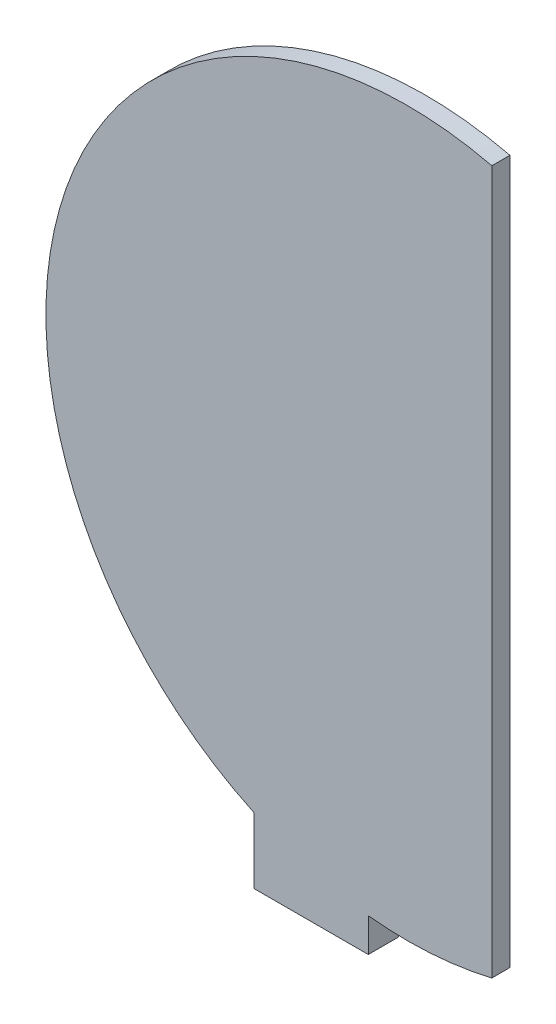
ISO-10303-21;
HEADER;
FILE_DESCRIPTION(('STEP AP214'),'2;1');
FILE_NAME('part.step','',(''),(''),'','','');
FILE_SCHEMA(('AUTOMOTIVE_DESIGN { 1 0 10303 214 1 1 1 1 }'));
ENDSEC;
DATA;
#1=APPLICATION_CONTEXT('core data for automotive mechanical design processes');
#2=APPLICATION_PROTOCOL_DEFINITION('international standard','automotive_design',2000,#1);
#3=PRODUCT_CONTEXT('',#1,'mechanical');
#4=PRODUCT('Part','Part','',(#3));
#5=PRODUCT_RELATED_PRODUCT_CATEGORY('part','',(#4));
#6=PRODUCT_DEFINITION_FORMATION('','',#4);
#7=PRODUCT_DEFINITION_CONTEXT('part definition',#1,'design');
#8=PRODUCT_DEFINITION('design','',#6,#7);
#9=PRODUCT_DEFINITION_SHAPE('','',#8);
#10=(LENGTH_UNIT() NAMED_UNIT(*) SI_UNIT(.MILLI.,.METRE.));
#11=(NAMED_UNIT(*) PLANE_ANGLE_UNIT() SI_UNIT($,.RADIAN.));
#12=(NAMED_UNIT(*) SI_UNIT($,.STERADIAN.) SOLID_ANGLE_UNIT());
#13=UNCERTAINTY_MEASURE_WITH_UNIT(LENGTH_MEASURE(1.E-05),#10,'distance_accuracy_value','');
#14=(GEOMETRIC_REPRESENTATION_CONTEXT(3) GLOBAL_UNCERTAINTY_ASSIGNED_CONTEXT((#13)) GLOBAL_UNIT_ASSIGNED_CONTEXT((#10,
#11,#12)) REPRESENTATION_CONTEXT('',''));
#15=CARTESIAN_POINT('',(0.,0.,0.));
#16=DIRECTION('',(0.,0.,1.));
#17=DIRECTION('',(1.,0.,0.));
#18=AXIS2_PLACEMENT_3D('',#15,#16,#17);
#19=CARTESIAN_POINT('',(-2.56182587296405,15.1062106918239,3.));
#20=DIRECTION('',(0.,0.,-1.));
#21=DIRECTION('',(-1.,0.,0.));
#22=AXIS2_PLACEMENT_3D('',#19,#20,#21);
#23=CYLINDRICAL_SURFACE('',#22,60.);
#24=CARTESIAN_POINT('',(-2.56182587296405,15.1062106918239,0.));
#25=DIRECTION('',(0.,0.,1.));
#26=DIRECTION('',(1.,0.,0.));
#27=AXIS2_PLACEMENT_3D('',#24,#25,#26);
#28=CIRCLE('',#27,60.);
#29=CARTESIAN_POINT('',(11.4193016972997,73.4545446171727,0.));
#30=VERTEX_POINT('',#29);
#31=CARTESIAN_POINT('',(-28.0806983027003,-39.1965254263023,0.));
#32=VERTEX_POINT('',#31);
#33=EDGE_CURVE('E81',#30,#32,#28,.T.);
#34=ORIENTED_EDGE('',*,*,#33,.T.);
#35=DIRECTION('',(0.,0.,-1.));
#36=VECTOR('',#35,1.);
#37=CARTESIAN_POINT('',(-28.0806983027003,-39.1965254263023,3.));
#38=LINE('',#37,#36);
#39=CARTESIAN_POINT('',(-28.0806983027003,-39.1965254263023,3.));
#40=VERTEX_POINT('',#39);
#41=EDGE_CURVE('E93',#32,#40,#38,.F.);
#42=ORIENTED_EDGE('',*,*,#41,.T.);
#43=CARTESIAN_POINT('',(-2.56182587296405,15.1062106918239,3.));
#44=DIRECTION('',(0.,0.,1.));
#45=DIRECTION('',(1.,0.,0.));
#46=AXIS2_PLACEMENT_3D('',#43,#44,#45);
#47=CIRCLE('',#46,60.);
#48=CARTESIAN_POINT('',(11.4193016972997,73.4545446171727,3.));
#49=VERTEX_POINT('',#48);
#50=EDGE_CURVE('E86',#49,#40,#47,.T.);
#51=ORIENTED_EDGE('',*,*,#50,.F.);
#52=DIRECTION('',(0.,0.,-1.));
#53=VECTOR('',#52,1.);
#54=CARTESIAN_POINT('',(11.4193016972997,73.4545446171727,3.));
#55=LINE('',#54,#53);
#56=EDGE_CURVE('E73',#49,#30,#55,.T.);
#57=ORIENTED_EDGE('',*,*,#56,.T.);
#58=EDGE_LOOP('',(#34,#42,#51,#57));
#59=FACE_BOUND('',#58,.T.);
#60=ADVANCED_FACE('F33',(#59),#23,.T.);
#61=CARTESIAN_POINT('',(-9.08069830270029,-44.538607207511,3.));
#62=VERTEX_POINT('',#61);
#63=CARTESIAN_POINT('',(11.4193016972997,-43.2421232335249,3.));
#64=VERTEX_POINT('',#63);
#65=EDGE_CURVE('E80',#62,#64,#47,.T.);
#66=ORIENTED_EDGE('',*,*,#65,.F.);
#67=DIRECTION('',(0.,0.,-1.));
#68=VECTOR('',#67,1.);
#69=CARTESIAN_POINT('',(-9.08069830270029,-44.538607207511,3.));
#70=LINE('',#69,#68);
#71=CARTESIAN_POINT('',(-9.08069830270029,-44.538607207511,0.));
#72=VERTEX_POINT('',#71);
#73=EDGE_CURVE('E120',#62,#72,#70,.T.);
#74=ORIENTED_EDGE('',*,*,#73,.T.);
#75=CARTESIAN_POINT('',(11.4193016972997,-43.2421232335249,0.));
#76=VERTEX_POINT('',#75);
#77=EDGE_CURVE('E91',#72,#76,#28,.T.);
#78=ORIENTED_EDGE('',*,*,#77,.T.);
#79=DIRECTION('',(0.,0.,-1.));
#80=VECTOR('',#79,1.);
#81=CARTESIAN_POINT('',(11.4193016972997,-43.2421232335249,3.));
#82=LINE('',#81,#80);
#83=EDGE_CURVE('E76',#64,#76,#82,.T.);
#84=ORIENTED_EDGE('',*,*,#83,.F.);
#85=EDGE_LOOP('',(#66,#74,#78,#84));
#86=FACE_BOUND('',#85,.T.);
#87=ADVANCED_FACE('F35',(#86),#23,.T.);
#88=CARTESIAN_POINT('',(11.4193016972997,73.4545446171727,3.));
#89=DIRECTION('',(-1.,0.,0.));
#90=DIRECTION('',(0.,0.,1.));
#91=AXIS2_PLACEMENT_3D('',#88,#89,#90);
#92=PLANE('',#91);
#93=DIRECTION('',(0.,1.,0.));
#94=VECTOR('',#93,1.);
#95=CARTESIAN_POINT('',(11.4193016972997,73.4545446171727,0.));
#96=LINE('',#95,#94);
#97=EDGE_CURVE('E70',#76,#30,#96,.T.);
#98=ORIENTED_EDGE('',*,*,#97,.T.);
#99=ORIENTED_EDGE('',*,*,#56,.F.);
#100=DIRECTION('',(0.,1.,0.));
#101=VECTOR('',#100,1.);
#102=CARTESIAN_POINT('',(11.4193016972997,73.4545446171727,3.));
#103=LINE('',#102,#101);
#104=EDGE_CURVE('E57',#64,#49,#103,.T.);
#105=ORIENTED_EDGE('',*,*,#104,.F.);
#106=ORIENTED_EDGE('',*,*,#83,.T.);
#107=EDGE_LOOP('',(#98,#99,#105,#106));
#108=FACE_BOUND('',#107,.T.);
#109=ADVANCED_FACE('F72',(#108),#92,.F.);
#110=CARTESIAN_POINT('',(-2.56182587296405,15.1062106918239,3.));
#111=DIRECTION('',(0.,0.,1.));
#112=DIRECTION('',(1.,0.,0.));
#113=AXIS2_PLACEMENT_3D('',#110,#111,#112);
#114=PLANE('',#113);
#115=ORIENTED_EDGE('',*,*,#50,.T.);
#116=DIRECTION('',(0.,-1.,0.));
#117=VECTOR('',#116,1.);
#118=CARTESIAN_POINT('',(-28.0806983027003,-50.1210917906914,3.));
#119=LINE('',#118,#117);
#120=CARTESIAN_POINT('',(-28.0806983027003,-50.1210917906914,3.));
#121=VERTEX_POINT('',#120);
#122=EDGE_CURVE('E149',#40,#121,#119,.T.);
#123=ORIENTED_EDGE('',*,*,#122,.T.);
#124=DIRECTION('',(1.,0.,0.));
#125=VECTOR('',#124,1.);
#126=CARTESIAN_POINT('',(-28.0806983027003,-50.1210917906914,3.));
#127=LINE('',#126,#125);
#128=CARTESIAN_POINT('',(-9.08069830270029,-50.1210917906914,3.));
#129=VERTEX_POINT('',#128);
#130=EDGE_CURVE('E157',#121,#129,#127,.T.);
#131=ORIENTED_EDGE('',*,*,#130,.T.);
#132=DIRECTION('',(0.,1.,0.));
#133=VECTOR('',#132,1.);
#134=CARTESIAN_POINT('',(-9.08069830270029,-50.1210917906914,3.));
#135=LINE('',#134,#133);
#136=EDGE_CURVE('E138',#129,#62,#135,.T.);
#137=ORIENTED_EDGE('',*,*,#136,.T.);
#138=ORIENTED_EDGE('',*,*,#65,.T.);
#139=ORIENTED_EDGE('',*,*,#104,.T.);
#140=EDGE_LOOP('',(#115,#123,#131,#137,#138,#139));
#141=FACE_BOUND('',#140,.T.);
#142=ADVANCED_FACE('F134',(#141),#114,.T.);
#143=CARTESIAN_POINT('',(-2.56182587296405,15.1062106918239,0.));
#144=DIRECTION('',(0.,0.,1.));
#145=DIRECTION('',(1.,0.,0.));
#146=AXIS2_PLACEMENT_3D('',#143,#144,#145);
#147=PLANE('',#146);
#148=DIRECTION('',(-1.,0.,0.));
#149=VECTOR('',#148,1.);
#150=CARTESIAN_POINT('',(-2.56182587296404,-25.7769929716059,0.));
#151=LINE('',#150,#149);
#152=CARTESIAN_POINT('',(-9.08069830270029,-25.7769929716059,0.));
#153=VERTEX_POINT('',#152);
#154=CARTESIAN_POINT('',(-28.0806983027003,-25.7769929716059,0.));
#155=VERTEX_POINT('',#154);
#156=EDGE_CURVE('E41',#153,#155,#151,.T.);
#157=ORIENTED_EDGE('',*,*,#156,.T.);
#158=DIRECTION('',(0.,-1.,0.));
#159=VECTOR('',#158,1.);
#160=CARTESIAN_POINT('',(-28.0806983027003,15.1062106918239,0.));
#161=LINE('',#160,#159);
#162=EDGE_CURVE('E11',#155,#32,#161,.T.);
#163=ORIENTED_EDGE('',*,*,#162,.T.);
#164=ORIENTED_EDGE('',*,*,#33,.F.);
#165=ORIENTED_EDGE('',*,*,#97,.F.);
#166=ORIENTED_EDGE('',*,*,#77,.F.);
#167=DIRECTION('',(0.,1.,0.));
#168=VECTOR('',#167,1.);
#169=CARTESIAN_POINT('',(-9.0806983027003,15.1062106918239,0.));
#170=LINE('',#169,#168);
#171=EDGE_CURVE('E98',#72,#153,#170,.T.);
#172=ORIENTED_EDGE('',*,*,#171,.T.);
#173=EDGE_LOOP('',(#157,#163,#164,#165,#166,#172));
#174=FACE_BOUND('',#173,.T.);
#175=ADVANCED_FACE('F89',(#174),#147,.F.);
#176=CARTESIAN_POINT('',(-28.0806983027003,-50.1210917906914,-2.));
#177=DIRECTION('',(-1.,0.,0.));
#178=DIRECTION('',(0.,-1.,0.));
#179=AXIS2_PLACEMENT_3D('',#176,#177,#178);
#180=PLANE('',#179);
#181=ORIENTED_EDGE('',*,*,#41,.F.);
#182=ORIENTED_EDGE('',*,*,#162,.F.);
#183=DIRECTION('',(0.,0.,1.));
#184=VECTOR('',#183,1.);
#185=CARTESIAN_POINT('',(-28.0806983027003,-25.7769929716059,-2.));
#186=LINE('',#185,#184);
#187=CARTESIAN_POINT('',(-28.0806983027003,-25.7769929716059,-2.));
#188=VERTEX_POINT('',#187);
#189=EDGE_CURVE('E111',#188,#155,#186,.T.);
#190=ORIENTED_EDGE('',*,*,#189,.F.);
#191=DIRECTION('',(0.,-1.,0.));
#192=VECTOR('',#191,1.);
#193=CARTESIAN_POINT('',(-28.0806983027003,-50.1210917906914,-2.));
#194=LINE('',#193,#192);
#195=CARTESIAN_POINT('',(-28.0806983027003,-50.1210917906914,-2.));
#196=VERTEX_POINT('',#195);
#197=EDGE_CURVE('E128',#188,#196,#194,.T.);
#198=ORIENTED_EDGE('',*,*,#197,.T.);
#199=DIRECTION('',(0.,0.,1.));
#200=VECTOR('',#199,1.);
#201=CARTESIAN_POINT('',(-28.0806983027003,-50.1210917906914,-2.));
#202=LINE('',#201,#200);
#203=EDGE_CURVE('E117',#196,#121,#202,.T.);
#204=ORIENTED_EDGE('',*,*,#203,.T.);
#205=ORIENTED_EDGE('',*,*,#122,.F.);
#206=EDGE_LOOP('',(#181,#182,#190,#198,#204,#205));
#207=FACE_BOUND('',#206,.T.);
#208=ADVANCED_FACE('F148',(#207),#180,.T.);
#209=CARTESIAN_POINT('',(-28.0806983027003,-25.7769929716059,-2.));
#210=DIRECTION('',(0.,1.,0.));
#211=DIRECTION('',(-1.,0.,0.));
#212=AXIS2_PLACEMENT_3D('',#209,#210,#211);
#213=PLANE('',#212);
#214=ORIENTED_EDGE('',*,*,#156,.F.);
#215=DIRECTION('',(0.,0.,1.));
#216=VECTOR('',#215,1.);
#217=CARTESIAN_POINT('',(-9.08069830270029,-25.7769929716059,-2.));
#218=LINE('',#217,#216);
#219=CARTESIAN_POINT('',(-9.08069830270029,-25.7769929716059,-2.));
#220=VERTEX_POINT('',#219);
#221=EDGE_CURVE('E48',#220,#153,#218,.T.);
#222=ORIENTED_EDGE('',*,*,#221,.F.);
#223=DIRECTION('',(-1.,0.,0.));
#224=VECTOR('',#223,1.);
#225=CARTESIAN_POINT('',(-28.0806983027003,-25.7769929716059,-2.));
#226=LINE('',#225,#224);
#227=EDGE_CURVE('E113',#220,#188,#226,.T.);
#228=ORIENTED_EDGE('',*,*,#227,.T.);
#229=ORIENTED_EDGE('',*,*,#189,.T.);
#230=EDGE_LOOP('',(#214,#222,#228,#229));
#231=FACE_BOUND('',#230,.T.);
#232=ADVANCED_FACE('F106',(#231),#213,.T.);
#233=CARTESIAN_POINT('',(-9.08069830270029,-50.1210917906914,-2.));
#234=DIRECTION('',(1.,0.,0.));
#235=DIRECTION('',(0.,1.,0.));
#236=AXIS2_PLACEMENT_3D('',#233,#234,#235);
#237=PLANE('',#236);
#238=ORIENTED_EDGE('',*,*,#73,.F.);
#239=ORIENTED_EDGE('',*,*,#136,.F.);
#240=DIRECTION('',(0.,0.,1.));
#241=VECTOR('',#240,1.);
#242=CARTESIAN_POINT('',(-9.08069830270029,-50.1210917906914,-2.));
#243=LINE('',#242,#241);
#244=CARTESIAN_POINT('',(-9.08069830270029,-50.1210917906914,-2.));
#245=VERTEX_POINT('',#244);
#246=EDGE_CURVE('E122',#245,#129,#243,.T.);
#247=ORIENTED_EDGE('',*,*,#246,.F.);
#248=DIRECTION('',(0.,1.,0.));
#249=VECTOR('',#248,1.);
#250=CARTESIAN_POINT('',(-9.08069830270029,-50.1210917906914,-2.));
#251=LINE('',#250,#249);
#252=EDGE_CURVE('E155',#245,#220,#251,.T.);
#253=ORIENTED_EDGE('',*,*,#252,.T.);
#254=ORIENTED_EDGE('',*,*,#221,.T.);
#255=ORIENTED_EDGE('',*,*,#171,.F.);
#256=EDGE_LOOP('',(#238,#239,#247,#253,#254,#255));
#257=FACE_BOUND('',#256,.T.);
#258=ADVANCED_FACE('F165',(#257),#237,.T.);
#259=CARTESIAN_POINT('',(-28.0806983027003,-50.1210917906914,-2.));
#260=DIRECTION('',(0.,-1.,0.));
#261=DIRECTION('',(1.,0.,0.));
#262=AXIS2_PLACEMENT_3D('',#259,#260,#261);
#263=PLANE('',#262);
#264=ORIENTED_EDGE('',*,*,#130,.F.);
#265=ORIENTED_EDGE('',*,*,#203,.F.);
#266=DIRECTION('',(1.,0.,0.));
#267=VECTOR('',#266,1.);
#268=CARTESIAN_POINT('',(-28.0806983027003,-50.1210917906914,-2.));
#269=LINE('',#268,#267);
#270=EDGE_CURVE('E153',#196,#245,#269,.T.);
#271=ORIENTED_EDGE('',*,*,#270,.T.);
#272=ORIENTED_EDGE('',*,*,#246,.T.);
#273=EDGE_LOOP('',(#264,#265,#271,#272));
#274=FACE_BOUND('',#273,.T.);
#275=ADVANCED_FACE('F173',(#274),#263,.T.);
#276=CARTESIAN_POINT('',(0.,0.,-2.));
#277=DIRECTION('',(0.,0.,1.));
#278=DIRECTION('',(1.,0.,0.));
#279=AXIS2_PLACEMENT_3D('',#276,#277,#278);
#280=PLANE('',#279);
#281=ORIENTED_EDGE('',*,*,#270,.F.);
#282=ORIENTED_EDGE('',*,*,#197,.F.);
#283=ORIENTED_EDGE('',*,*,#227,.F.);
#284=ORIENTED_EDGE('',*,*,#252,.F.);
#285=EDGE_LOOP('',(#281,#282,#283,#284));
#286=FACE_BOUND('',#285,.T.);
#287=ADVANCED_FACE('F170',(#286),#280,.F.);
#288=CLOSED_SHELL('',(#60,#87,#109,#142,#175,#208,#232,#258,#275,#287));
#289=MANIFOLD_SOLID_BREP('B2',#288);
#290=ADVANCED_BREP_SHAPE_REPRESENTATION('',(#18,#289),#14);
#291=SHAPE_DEFINITION_REPRESENTATION(#9,#290);
ENDSEC;
END-ISO-10303-21;
